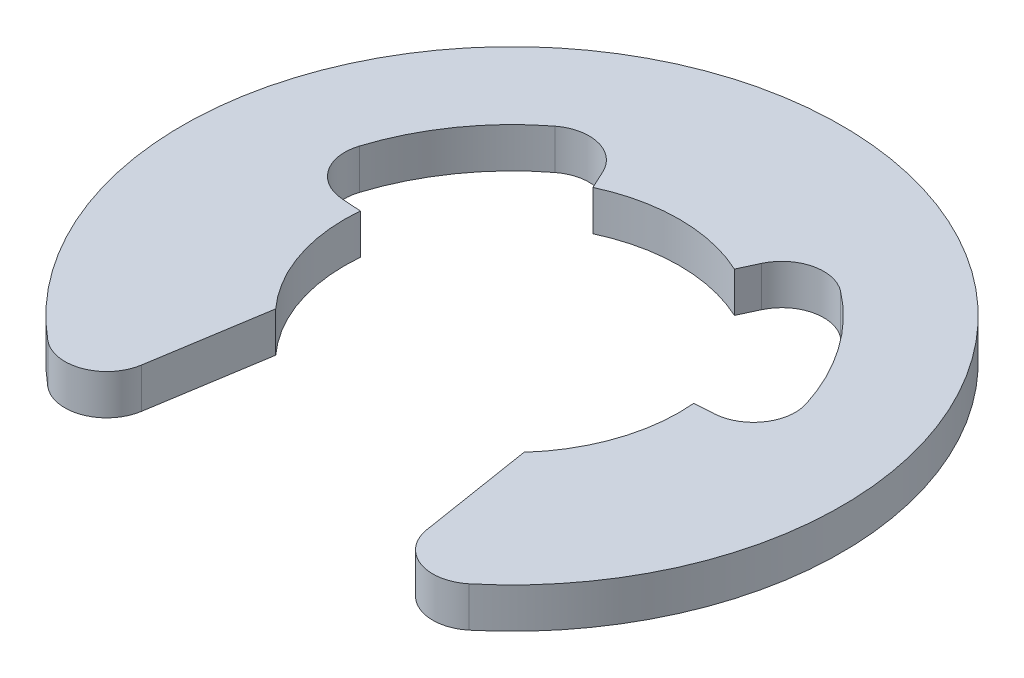
ISO-10303-21;
HEADER;
FILE_DESCRIPTION(('STEP AP214'),'2;1');
FILE_NAME('part.step','',(''),(''),'','','');
FILE_SCHEMA(('AUTOMOTIVE_DESIGN { 1 0 10303 214 1 1 1 1 }'));
ENDSEC;
DATA;
#1=APPLICATION_CONTEXT('core data for automotive mechanical design processes');
#2=APPLICATION_PROTOCOL_DEFINITION('international standard','automotive_design',2000,#1);
#3=PRODUCT_CONTEXT('',#1,'mechanical');
#4=PRODUCT('Part','Part','',(#3));
#5=PRODUCT_RELATED_PRODUCT_CATEGORY('part','',(#4));
#6=PRODUCT_DEFINITION_FORMATION('','',#4);
#7=PRODUCT_DEFINITION_CONTEXT('part definition',#1,'design');
#8=PRODUCT_DEFINITION('design','',#6,#7);
#9=PRODUCT_DEFINITION_SHAPE('','',#8);
#10=(LENGTH_UNIT() NAMED_UNIT(*) SI_UNIT(.MILLI.,.METRE.));
#11=(NAMED_UNIT(*) PLANE_ANGLE_UNIT() SI_UNIT($,.RADIAN.));
#12=(NAMED_UNIT(*) SI_UNIT($,.STERADIAN.) SOLID_ANGLE_UNIT());
#13=UNCERTAINTY_MEASURE_WITH_UNIT(LENGTH_MEASURE(1.E-05),#10,'distance_accuracy_value','');
#14=(GEOMETRIC_REPRESENTATION_CONTEXT(3) GLOBAL_UNCERTAINTY_ASSIGNED_CONTEXT((#13)) GLOBAL_UNIT_ASSIGNED_CONTEXT((#10,
#11,#12)) REPRESENTATION_CONTEXT('',''));
#15=CARTESIAN_POINT('',(0.,0.,0.));
#16=DIRECTION('',(0.,0.,1.));
#17=DIRECTION('',(1.,0.,0.));
#18=AXIS2_PLACEMENT_3D('',#15,#16,#17);
#19=CARTESIAN_POINT('',(3.50482384503729,1.2,-4.55836701190877));
#20=DIRECTION('',(0.,-1.,0.));
#21=DIRECTION('',(0.,0.,-1.));
#22=AXIS2_PLACEMENT_3D('',#19,#20,#21);
#23=CYLINDRICAL_SURFACE('',#22,1.24999999999999);
#24=CARTESIAN_POINT('',(3.50482384503729,0.,-4.55836701190877));
#25=DIRECTION('',(0.,-1.,0.));
#26=DIRECTION('',(0.,0.,-1.));
#27=AXIS2_PLACEMENT_3D('',#24,#25,#26);
#28=CIRCLE('',#27,1.24999999999999);
#29=CARTESIAN_POINT('',(2.37193911124148,0.,-5.08663983908464));
#30=VERTEX_POINT('',#29);
#31=CARTESIAN_POINT('',(4.2667420722193,0.,-5.54931636232372));
#32=VERTEX_POINT('',#31);
#33=EDGE_CURVE('E192',#30,#32,#28,.T.);
#34=ORIENTED_EDGE('',*,*,#33,.T.);
#35=DIRECTION('',(0.,-1.,0.));
#36=VECTOR('',#35,1.);
#37=CARTESIAN_POINT('',(4.2667420722193,1.2,-5.54931636232372));
#38=LINE('',#37,#36);
#39=CARTESIAN_POINT('',(4.2667420722193,1.2,-5.54931636232372));
#40=VERTEX_POINT('',#39);
#41=EDGE_CURVE('E11',#40,#32,#38,.T.);
#42=ORIENTED_EDGE('',*,*,#41,.F.);
#43=CARTESIAN_POINT('',(3.50482384503729,1.2,-4.55836701190877));
#44=DIRECTION('',(0.,-1.,0.));
#45=DIRECTION('',(0.,0.,-1.));
#46=AXIS2_PLACEMENT_3D('',#43,#44,#45);
#47=CIRCLE('',#46,1.24999999999999);
#48=CARTESIAN_POINT('',(2.37193911124148,1.2,-5.08663983908464));
#49=VERTEX_POINT('',#48);
#50=EDGE_CURVE('E226',#49,#40,#47,.T.);
#51=ORIENTED_EDGE('',*,*,#50,.F.);
#52=DIRECTION('',(0.,-1.,0.));
#53=VECTOR('',#52,1.);
#54=CARTESIAN_POINT('',(2.37193911124148,1.2,-5.08663983908464));
#55=LINE('',#54,#53);
#56=EDGE_CURVE('E188',#49,#30,#55,.T.);
#57=ORIENTED_EDGE('',*,*,#56,.T.);
#58=EDGE_LOOP('',(#34,#42,#51,#57));
#59=FACE_BOUND('',#58,.T.);
#60=ADVANCED_FACE('F36',(#59),#23,.F.);
#61=CARTESIAN_POINT('',(0.,1.2,0.));
#62=DIRECTION('',(0.,-1.,0.));
#63=DIRECTION('',(0.,0.,-1.));
#64=AXIS2_PLACEMENT_3D('',#61,#62,#63);
#65=CYLINDRICAL_SURFACE('',#64,7.);
#66=CARTESIAN_POINT('',(0.,0.,0.));
#67=DIRECTION('',(0.,-1.,0.));
#68=DIRECTION('',(0.,0.,1.));
#69=AXIS2_PLACEMENT_3D('',#66,#67,#68);
#70=CIRCLE('',#69,7.);
#71=CARTESIAN_POINT('',(6.67396337115619,0.,-2.11144806245986));
#72=VERTEX_POINT('',#71);
#73=EDGE_CURVE('E195',#32,#72,#70,.T.);
#74=ORIENTED_EDGE('',*,*,#73,.T.);
#75=DIRECTION('',(0.,-1.,0.));
#76=VECTOR('',#75,1.);
#77=CARTESIAN_POINT('',(6.67396337115619,1.2,-2.11144806245986));
#78=LINE('',#77,#76);
#79=CARTESIAN_POINT('',(6.67396337115619,1.2,-2.11144806245986));
#80=VERTEX_POINT('',#79);
#81=EDGE_CURVE('E44',#80,#72,#78,.T.);
#82=ORIENTED_EDGE('',*,*,#81,.F.);
#83=CARTESIAN_POINT('',(0.,1.2,0.));
#84=DIRECTION('',(0.,-1.,0.));
#85=DIRECTION('',(0.,0.,1.));
#86=AXIS2_PLACEMENT_3D('',#83,#84,#85);
#87=CIRCLE('',#86,7.);
#88=EDGE_CURVE('E125',#40,#80,#87,.T.);
#89=ORIENTED_EDGE('',*,*,#88,.F.);
#90=ORIENTED_EDGE('',*,*,#41,.T.);
#91=EDGE_LOOP('',(#74,#82,#89,#90));
#92=FACE_BOUND('',#91,.T.);
#93=ADVANCED_FACE('F334',(#92),#65,.F.);
#94=CARTESIAN_POINT('',(5.48218419773545,1.2,-1.73440376559203));
#95=DIRECTION('',(0.,-1.,0.));
#96=DIRECTION('',(0.,0.,-1.));
#97=AXIS2_PLACEMENT_3D('',#94,#95,#96);
#98=CYLINDRICAL_SURFACE('',#97,1.24999999999999);
#99=CARTESIAN_POINT('',(5.48218419773545,0.,-1.73440376559203));
#100=DIRECTION('',(0.,-1.,0.));
#101=DIRECTION('',(0.,0.,1.));
#102=AXIS2_PLACEMENT_3D('',#99,#100,#101);
#103=CIRCLE('',#102,1.24999999999999);
#104=CARTESIAN_POINT('',(5.56808287520105,0.,-0.487358691342648));
#105=VERTEX_POINT('',#104);
#106=EDGE_CURVE('E197',#72,#105,#103,.T.);
#107=ORIENTED_EDGE('',*,*,#106,.T.);
#108=DIRECTION('',(0.,-1.,0.));
#109=VECTOR('',#108,1.);
#110=CARTESIAN_POINT('',(5.56808287520105,1.2,-0.487358691342648));
#111=LINE('',#110,#109);
#112=CARTESIAN_POINT('',(5.56808287520105,1.2,-0.487358691342648));
#113=VERTEX_POINT('',#112);
#114=EDGE_CURVE('E263',#113,#105,#111,.T.);
#115=ORIENTED_EDGE('',*,*,#114,.F.);
#116=CARTESIAN_POINT('',(5.48218419773545,1.2,-1.73440376559203));
#117=DIRECTION('',(0.,-1.,0.));
#118=DIRECTION('',(0.,0.,1.));
#119=AXIS2_PLACEMENT_3D('',#116,#117,#118);
#120=CIRCLE('',#119,1.24999999999999);
#121=EDGE_CURVE('E271',#80,#113,#120,.T.);
#122=ORIENTED_EDGE('',*,*,#121,.F.);
#123=ORIENTED_EDGE('',*,*,#81,.T.);
#124=EDGE_LOOP('',(#107,#115,#122,#123));
#125=FACE_BOUND('',#124,.T.);
#126=ADVANCED_FACE('F269',(#125),#98,.F.);
#127=CARTESIAN_POINT('',(4.97999247932663,1.2,-0.446849981369804));
#128=DIRECTION('',(0.0687189419724793,0.,0.99763605939951));
#129=DIRECTION('',(0.99763605939951,0.,-0.0687189419724793));
#130=AXIS2_PLACEMENT_3D('',#127,#128,#129);
#131=PLANE('',#130);
#132=DIRECTION('',(-0.99763605939951,0.,0.0687189419724793));
#133=VECTOR('',#132,1.);
#134=CARTESIAN_POINT('',(4.97999247932663,0.,-0.446849981369804));
#135=LINE('',#134,#133);
#136=CARTESIAN_POINT('',(4.97999247932663,0.,-0.446849981369804));
#137=VERTEX_POINT('',#136);
#138=EDGE_CURVE('E199',#105,#137,#135,.T.);
#139=ORIENTED_EDGE('',*,*,#138,.T.);
#140=DIRECTION('',(0.,-1.,0.));
#141=VECTOR('',#140,1.);
#142=CARTESIAN_POINT('',(4.97999247932663,1.2,-0.446849981369804));
#143=LINE('',#142,#141);
#144=CARTESIAN_POINT('',(4.97999247932663,1.2,-0.446849981369804));
#145=VERTEX_POINT('',#144);
#146=EDGE_CURVE('E260',#145,#137,#143,.T.);
#147=ORIENTED_EDGE('',*,*,#146,.F.);
#148=DIRECTION('',(-0.99763605939951,0.,0.0687189419724793));
#149=VECTOR('',#148,1.);
#150=CARTESIAN_POINT('',(4.97999247932663,1.2,-0.446849981369804));
#151=LINE('',#150,#149);
#152=EDGE_CURVE('E289',#113,#145,#151,.T.);
#153=ORIENTED_EDGE('',*,*,#152,.F.);
#154=ORIENTED_EDGE('',*,*,#114,.T.);
#155=EDGE_LOOP('',(#139,#147,#153,#154));
#156=FACE_BOUND('',#155,.T.);
#157=ADVANCED_FACE('F280',(#156),#131,.F.);
#158=CARTESIAN_POINT('',(0.,1.2,0.));
#159=DIRECTION('',(0.,-1.,0.));
#160=DIRECTION('',(0.,0.,-1.));
#161=AXIS2_PLACEMENT_3D('',#158,#159,#160);
#162=CYLINDRICAL_SURFACE('',#161,5.);
#163=CARTESIAN_POINT('',(0.,0.,0.));
#164=DIRECTION('',(0.,-1.,0.));
#165=DIRECTION('',(0.,0.,1.));
#166=AXIS2_PLACEMENT_3D('',#163,#164,#165);
#167=CIRCLE('',#166,5.);
#168=CARTESIAN_POINT('',(3.71082851381224,0.,3.35108217462331));
#169=VERTEX_POINT('',#168);
#170=EDGE_CURVE('E201',#137,#169,#167,.T.);
#171=ORIENTED_EDGE('',*,*,#170,.T.);
#172=DIRECTION('',(0.,-1.,0.));
#173=VECTOR('',#172,1.);
#174=CARTESIAN_POINT('',(3.71082851381224,1.2,3.35108217462331));
#175=LINE('',#174,#173);
#176=CARTESIAN_POINT('',(3.71082851381224,1.2,3.35108217462331));
#177=VERTEX_POINT('',#176);
#178=EDGE_CURVE('E257',#177,#169,#175,.T.);
#179=ORIENTED_EDGE('',*,*,#178,.F.);
#180=CARTESIAN_POINT('',(0.,1.2,0.));
#181=DIRECTION('',(0.,-1.,0.));
#182=DIRECTION('',(0.,0.,1.));
#183=AXIS2_PLACEMENT_3D('',#180,#181,#182);
#184=CIRCLE('',#183,5.);
#185=EDGE_CURVE('E286',#145,#177,#184,.T.);
#186=ORIENTED_EDGE('',*,*,#185,.F.);
#187=ORIENTED_EDGE('',*,*,#146,.T.);
#188=EDGE_LOOP('',(#171,#179,#186,#187));
#189=FACE_BOUND('',#188,.T.);
#190=ADVANCED_FACE('F284',(#189),#162,.F.);
#191=CARTESIAN_POINT('',(3.71082851381224,1.2,3.35108217462331));
#192=DIRECTION('',(0.987539000514755,0.,-0.157374465725288));
#193=DIRECTION('',(-0.157374465725288,0.,-0.987539000514755));
#194=AXIS2_PLACEMENT_3D('',#191,#192,#193);
#195=PLANE('',#194);
#196=DIRECTION('',(0.157374465725288,0.,0.987539000514754));
#197=VECTOR('',#196,1.);
#198=CARTESIAN_POINT('',(3.71082851381224,0.,3.35108217462331));
#199=LINE('',#198,#197);
#200=CARTESIAN_POINT('',(4.26218467581493,0.,6.8108919388213));
#201=VERTEX_POINT('',#200);
#202=EDGE_CURVE('E203',#169,#201,#199,.T.);
#203=ORIENTED_EDGE('',*,*,#202,.T.);
#204=DIRECTION('',(0.,-1.,0.));
#205=VECTOR('',#204,1.);
#206=CARTESIAN_POINT('',(4.26218467581493,1.2,6.8108919388213));
#207=LINE('',#206,#205);
#208=CARTESIAN_POINT('',(4.26218467581493,1.2,6.8108919388213));
#209=VERTEX_POINT('',#208);
#210=EDGE_CURVE('E254',#209,#201,#207,.T.);
#211=ORIENTED_EDGE('',*,*,#210,.F.);
#212=DIRECTION('',(0.157374465725288,0.,0.987539000514754));
#213=VECTOR('',#212,1.);
#214=CARTESIAN_POINT('',(3.71082851381224,1.2,3.35108217462331));
#215=LINE('',#214,#213);
#216=EDGE_CURVE('E288',#177,#209,#215,.T.);
#217=ORIENTED_EDGE('',*,*,#216,.F.);
#218=ORIENTED_EDGE('',*,*,#178,.T.);
#219=EDGE_LOOP('',(#203,#211,#217,#218));
#220=FACE_BOUND('',#219,.T.);
#221=ADVANCED_FACE('F347',(#220),#195,.F.);
#222=CARTESIAN_POINT('',(5.49660842645838,1.2,6.61417385666469));
#223=DIRECTION('',(0.,-1.,0.));
#224=DIRECTION('',(0.,0.,-1.));
#225=AXIS2_PLACEMENT_3D('',#222,#223,#224);
#226=CYLINDRICAL_SURFACE('',#225,1.25);
#227=CARTESIAN_POINT('',(5.49660842645838,0.,6.61417385666469));
#228=DIRECTION('',(0.,1.,0.));
#229=DIRECTION('',(0.,0.,1.));
#230=AXIS2_PLACEMENT_3D('',#227,#228,#229);
#231=CIRCLE('',#230,1.25);
#232=CARTESIAN_POINT('',(6.29553406983896,0.,7.57553633583107));
#233=VERTEX_POINT('',#232);
#234=EDGE_CURVE('E205',#201,#233,#231,.T.);
#235=ORIENTED_EDGE('',*,*,#234,.T.);
#236=DIRECTION('',(0.,-1.,0.));
#237=VECTOR('',#236,1.);
#238=CARTESIAN_POINT('',(6.29553406983896,1.2,7.57553633583107));
#239=LINE('',#238,#237);
#240=CARTESIAN_POINT('',(6.29553406983896,1.2,7.57553633583107));
#241=VERTEX_POINT('',#240);
#242=EDGE_CURVE('E251',#241,#233,#239,.T.);
#243=ORIENTED_EDGE('',*,*,#242,.F.);
#244=CARTESIAN_POINT('',(5.49660842645838,1.2,6.61417385666469));
#245=DIRECTION('',(0.,1.,0.));
#246=DIRECTION('',(0.,0.,1.));
#247=AXIS2_PLACEMENT_3D('',#244,#245,#246);
#248=CIRCLE('',#247,1.25);
#249=EDGE_CURVE('E291',#209,#241,#248,.T.);
#250=ORIENTED_EDGE('',*,*,#249,.F.);
#251=ORIENTED_EDGE('',*,*,#210,.T.);
#252=EDGE_LOOP('',(#235,#243,#250,#251));
#253=FACE_BOUND('',#252,.T.);
#254=ADVANCED_FACE('F350',(#253),#226,.T.);
#255=CARTESIAN_POINT('',(0.,1.2,0.));
#256=DIRECTION('',(0.,-1.,0.));
#257=DIRECTION('',(0.,0.,-1.));
#258=AXIS2_PLACEMENT_3D('',#255,#256,#257);
#259=CYLINDRICAL_SURFACE('',#258,9.85);
#260=CARTESIAN_POINT('',(0.,0.,0.));
#261=DIRECTION('',(0.,1.,0.));
#262=DIRECTION('',(0.,0.,1.));
#263=AXIS2_PLACEMENT_3D('',#260,#261,#262);
#264=CIRCLE('',#263,9.85);
#265=CARTESIAN_POINT('',(-6.29553406983896,0.,7.57553633583108));
#266=VERTEX_POINT('',#265);
#267=EDGE_CURVE('E207',#233,#266,#264,.T.);
#268=ORIENTED_EDGE('',*,*,#267,.T.);
#269=DIRECTION('',(0.,-1.,0.));
#270=VECTOR('',#269,1.);
#271=CARTESIAN_POINT('',(-6.29553406983896,1.2,7.57553633583108));
#272=LINE('',#271,#270);
#273=CARTESIAN_POINT('',(-6.29553406983896,1.2,7.57553633583108));
#274=VERTEX_POINT('',#273);
#275=EDGE_CURVE('E248',#274,#266,#272,.T.);
#276=ORIENTED_EDGE('',*,*,#275,.F.);
#277=CARTESIAN_POINT('',(0.,1.2,0.));
#278=DIRECTION('',(0.,1.,0.));
#279=DIRECTION('',(0.,0.,1.));
#280=AXIS2_PLACEMENT_3D('',#277,#278,#279);
#281=CIRCLE('',#280,9.85);
#282=EDGE_CURVE('E297',#241,#274,#281,.T.);
#283=ORIENTED_EDGE('',*,*,#282,.F.);
#284=ORIENTED_EDGE('',*,*,#242,.T.);
#285=EDGE_LOOP('',(#268,#276,#283,#284));
#286=FACE_BOUND('',#285,.T.);
#287=ADVANCED_FACE('F354',(#286),#259,.T.);
#288=CARTESIAN_POINT('',(-5.49660842645838,1.2,6.61417385666469));
#289=DIRECTION('',(0.,-1.,0.));
#290=DIRECTION('',(0.,0.,-1.));
#291=AXIS2_PLACEMENT_3D('',#288,#289,#290);
#292=CYLINDRICAL_SURFACE('',#291,1.25);
#293=CARTESIAN_POINT('',(-5.49660842645838,0.,6.61417385666469));
#294=DIRECTION('',(0.,1.,0.));
#295=DIRECTION('',(0.,0.,-1.));
#296=AXIS2_PLACEMENT_3D('',#293,#294,#295);
#297=CIRCLE('',#296,1.25);
#298=CARTESIAN_POINT('',(-4.26218467581493,0.,6.8108919388213));
#299=VERTEX_POINT('',#298);
#300=EDGE_CURVE('E209',#266,#299,#297,.T.);
#301=ORIENTED_EDGE('',*,*,#300,.T.);
#302=DIRECTION('',(0.,-1.,0.));
#303=VECTOR('',#302,1.);
#304=CARTESIAN_POINT('',(-4.26218467581493,1.2,6.8108919388213));
#305=LINE('',#304,#303);
#306=CARTESIAN_POINT('',(-4.26218467581493,1.2,6.8108919388213));
#307=VERTEX_POINT('',#306);
#308=EDGE_CURVE('E245',#307,#299,#305,.T.);
#309=ORIENTED_EDGE('',*,*,#308,.F.);
#310=CARTESIAN_POINT('',(-5.49660842645838,1.2,6.61417385666469));
#311=DIRECTION('',(0.,1.,0.));
#312=DIRECTION('',(0.,0.,-1.));
#313=AXIS2_PLACEMENT_3D('',#310,#311,#312);
#314=CIRCLE('',#313,1.25);
#315=EDGE_CURVE('E299',#274,#307,#314,.T.);
#316=ORIENTED_EDGE('',*,*,#315,.F.);
#317=ORIENTED_EDGE('',*,*,#275,.T.);
#318=EDGE_LOOP('',(#301,#309,#316,#317));
#319=FACE_BOUND('',#318,.T.);
#320=ADVANCED_FACE('F358',(#319),#292,.T.);
#321=CARTESIAN_POINT('',(-3.71082851381224,1.2,3.35108217462331));
#322=DIRECTION('',(-0.987539000514755,0.,-0.157374465725287));
#323=DIRECTION('',(-0.157374465725287,0.,0.987539000514755));
#324=AXIS2_PLACEMENT_3D('',#321,#322,#323);
#325=PLANE('',#324);
#326=DIRECTION('',(0.157374465725287,0.,-0.987539000514755));
#327=VECTOR('',#326,1.);
#328=CARTESIAN_POINT('',(-3.71082851381224,0.,3.35108217462331));
#329=LINE('',#328,#327);
#330=CARTESIAN_POINT('',(-3.71082851381224,0.,3.35108217462331));
#331=VERTEX_POINT('',#330);
#332=EDGE_CURVE('E211',#299,#331,#329,.T.);
#333=ORIENTED_EDGE('',*,*,#332,.T.);
#334=DIRECTION('',(0.,-1.,0.));
#335=VECTOR('',#334,1.);
#336=CARTESIAN_POINT('',(-3.71082851381224,1.2,3.35108217462331));
#337=LINE('',#336,#335);
#338=CARTESIAN_POINT('',(-3.71082851381224,1.2,3.35108217462331));
#339=VERTEX_POINT('',#338);
#340=EDGE_CURVE('E242',#339,#331,#337,.T.);
#341=ORIENTED_EDGE('',*,*,#340,.F.);
#342=DIRECTION('',(0.157374465725287,0.,-0.987539000514755));
#343=VECTOR('',#342,1.);
#344=CARTESIAN_POINT('',(-3.71082851381224,1.2,3.35108217462331));
#345=LINE('',#344,#343);
#346=EDGE_CURVE('E301',#307,#339,#345,.T.);
#347=ORIENTED_EDGE('',*,*,#346,.F.);
#348=ORIENTED_EDGE('',*,*,#308,.T.);
#349=EDGE_LOOP('',(#333,#341,#347,#348));
#350=FACE_BOUND('',#349,.T.);
#351=ADVANCED_FACE('F362',(#350),#325,.F.);
#352=CARTESIAN_POINT('',(0.,1.2,0.));
#353=DIRECTION('',(0.,-1.,0.));
#354=DIRECTION('',(0.,0.,-1.));
#355=AXIS2_PLACEMENT_3D('',#352,#353,#354);
#356=CYLINDRICAL_SURFACE('',#355,5.);
#357=CARTESIAN_POINT('',(0.,0.,0.));
#358=DIRECTION('',(0.,-1.,0.));
#359=DIRECTION('',(0.,0.,-1.));
#360=AXIS2_PLACEMENT_3D('',#357,#358,#359);
#361=CIRCLE('',#360,5.);
#362=CARTESIAN_POINT('',(-4.97999247932663,0.,-0.446849981369804));
#363=VERTEX_POINT('',#362);
#364=EDGE_CURVE('E213',#331,#363,#361,.T.);
#365=ORIENTED_EDGE('',*,*,#364,.T.);
#366=DIRECTION('',(0.,-1.,0.));
#367=VECTOR('',#366,1.);
#368=CARTESIAN_POINT('',(-4.97999247932663,1.2,-0.446849981369804));
#369=LINE('',#368,#367);
#370=CARTESIAN_POINT('',(-4.97999247932663,1.2,-0.446849981369804));
#371=VERTEX_POINT('',#370);
#372=EDGE_CURVE('E239',#371,#363,#369,.T.);
#373=ORIENTED_EDGE('',*,*,#372,.F.);
#374=CARTESIAN_POINT('',(0.,1.2,0.));
#375=DIRECTION('',(0.,-1.,0.));
#376=DIRECTION('',(0.,0.,-1.));
#377=AXIS2_PLACEMENT_3D('',#374,#375,#376);
#378=CIRCLE('',#377,5.);
#379=EDGE_CURVE('E303',#339,#371,#378,.T.);
#380=ORIENTED_EDGE('',*,*,#379,.F.);
#381=ORIENTED_EDGE('',*,*,#340,.T.);
#382=EDGE_LOOP('',(#365,#373,#380,#381));
#383=FACE_BOUND('',#382,.T.);
#384=ADVANCED_FACE('F366',(#383),#356,.F.);
#385=CARTESIAN_POINT('',(-4.97999247932663,1.2,-0.446849981369804));
#386=DIRECTION('',(-0.0687189419724795,0.,0.99763605939951));
#387=DIRECTION('',(0.99763605939951,0.,0.0687189419724795));
#388=AXIS2_PLACEMENT_3D('',#385,#386,#387);
#389=PLANE('',#388);
#390=DIRECTION('',(-0.99763605939951,0.,-0.0687189419724795));
#391=VECTOR('',#390,1.);
#392=CARTESIAN_POINT('',(-4.97999247932663,0.,-0.446849981369804));
#393=LINE('',#392,#391);
#394=CARTESIAN_POINT('',(-5.56808287520105,0.,-0.487358691342647));
#395=VERTEX_POINT('',#394);
#396=EDGE_CURVE('E215',#363,#395,#393,.T.);
#397=ORIENTED_EDGE('',*,*,#396,.T.);
#398=DIRECTION('',(0.,-1.,0.));
#399=VECTOR('',#398,1.);
#400=CARTESIAN_POINT('',(-5.56808287520105,1.2,-0.487358691342647));
#401=LINE('',#400,#399);
#402=CARTESIAN_POINT('',(-5.56808287520105,1.2,-0.487358691342647));
#403=VERTEX_POINT('',#402);
#404=EDGE_CURVE('E236',#403,#395,#401,.T.);
#405=ORIENTED_EDGE('',*,*,#404,.F.);
#406=DIRECTION('',(-0.99763605939951,0.,-0.0687189419724795));
#407=VECTOR('',#406,1.);
#408=CARTESIAN_POINT('',(-4.97999247932663,1.2,-0.446849981369804));
#409=LINE('',#408,#407);
#410=EDGE_CURVE('E305',#371,#403,#409,.T.);
#411=ORIENTED_EDGE('',*,*,#410,.F.);
#412=ORIENTED_EDGE('',*,*,#372,.T.);
#413=EDGE_LOOP('',(#397,#405,#411,#412));
#414=FACE_BOUND('',#413,.T.);
#415=ADVANCED_FACE('F370',(#414),#389,.F.);
#416=CARTESIAN_POINT('',(-5.48218419773545,1.2,-1.73440376559203));
#417=DIRECTION('',(0.,-1.,0.));
#418=DIRECTION('',(0.,0.,-1.));
#419=AXIS2_PLACEMENT_3D('',#416,#417,#418);
#420=CYLINDRICAL_SURFACE('',#419,1.25);
#421=CARTESIAN_POINT('',(-5.48218419773545,0.,-1.73440376559203));
#422=DIRECTION('',(0.,-1.,0.));
#423=DIRECTION('',(0.,0.,-1.));
#424=AXIS2_PLACEMENT_3D('',#421,#422,#423);
#425=CIRCLE('',#424,1.25);
#426=CARTESIAN_POINT('',(-6.67396337115619,0.,-2.11144806245986));
#427=VERTEX_POINT('',#426);
#428=EDGE_CURVE('E217',#395,#427,#425,.T.);
#429=ORIENTED_EDGE('',*,*,#428,.T.);
#430=DIRECTION('',(0.,-1.,0.));
#431=VECTOR('',#430,1.);
#432=CARTESIAN_POINT('',(-6.67396337115619,1.2,-2.11144806245986));
#433=LINE('',#432,#431);
#434=CARTESIAN_POINT('',(-6.67396337115619,1.2,-2.11144806245986));
#435=VERTEX_POINT('',#434);
#436=EDGE_CURVE('E233',#435,#427,#433,.T.);
#437=ORIENTED_EDGE('',*,*,#436,.F.);
#438=CARTESIAN_POINT('',(-5.48218419773545,1.2,-1.73440376559203));
#439=DIRECTION('',(0.,-1.,0.));
#440=DIRECTION('',(0.,0.,-1.));
#441=AXIS2_PLACEMENT_3D('',#438,#439,#440);
#442=CIRCLE('',#441,1.25);
#443=EDGE_CURVE('E307',#403,#435,#442,.T.);
#444=ORIENTED_EDGE('',*,*,#443,.F.);
#445=ORIENTED_EDGE('',*,*,#404,.T.);
#446=EDGE_LOOP('',(#429,#437,#444,#445));
#447=FACE_BOUND('',#446,.T.);
#448=ADVANCED_FACE('F374',(#447),#420,.F.);
#449=CARTESIAN_POINT('',(0.,1.2,0.));
#450=DIRECTION('',(0.,-1.,0.));
#451=DIRECTION('',(0.,0.,-1.));
#452=AXIS2_PLACEMENT_3D('',#449,#450,#451);
#453=CYLINDRICAL_SURFACE('',#452,7.);
#454=CARTESIAN_POINT('',(0.,0.,0.));
#455=DIRECTION('',(0.,-1.,0.));
#456=DIRECTION('',(0.,0.,-1.));
#457=AXIS2_PLACEMENT_3D('',#454,#455,#456);
#458=CIRCLE('',#457,7.);
#459=CARTESIAN_POINT('',(-4.2667420722193,0.,-5.54931636232372));
#460=VERTEX_POINT('',#459);
#461=EDGE_CURVE('E219',#427,#460,#458,.T.);
#462=ORIENTED_EDGE('',*,*,#461,.T.);
#463=DIRECTION('',(0.,-1.,0.));
#464=VECTOR('',#463,1.);
#465=CARTESIAN_POINT('',(-4.2667420722193,1.2,-5.54931636232372));
#466=LINE('',#465,#464);
#467=CARTESIAN_POINT('',(-4.2667420722193,1.2,-5.54931636232372));
#468=VERTEX_POINT('',#467);
#469=EDGE_CURVE('E230',#468,#460,#466,.T.);
#470=ORIENTED_EDGE('',*,*,#469,.F.);
#471=CARTESIAN_POINT('',(0.,1.2,0.));
#472=DIRECTION('',(0.,-1.,0.));
#473=DIRECTION('',(0.,0.,-1.));
#474=AXIS2_PLACEMENT_3D('',#471,#472,#473);
#475=CIRCLE('',#474,7.);
#476=EDGE_CURVE('E309',#435,#468,#475,.T.);
#477=ORIENTED_EDGE('',*,*,#476,.F.);
#478=ORIENTED_EDGE('',*,*,#436,.T.);
#479=EDGE_LOOP('',(#462,#470,#477,#478));
#480=FACE_BOUND('',#479,.T.);
#481=ADVANCED_FACE('F315',(#480),#453,.F.);
#482=CARTESIAN_POINT('',(-3.50482384503729,1.2,-4.55836701190877));
#483=DIRECTION('',(0.,-1.,0.));
#484=DIRECTION('',(0.,0.,-1.));
#485=AXIS2_PLACEMENT_3D('',#482,#483,#484);
#486=CYLINDRICAL_SURFACE('',#485,1.24999999999999);
#487=CARTESIAN_POINT('',(-3.50482384503729,0.,-4.55836701190877));
#488=DIRECTION('',(0.,-1.,0.));
#489=DIRECTION('',(0.,0.,1.));
#490=AXIS2_PLACEMENT_3D('',#487,#488,#489);
#491=CIRCLE('',#490,1.24999999999999);
#492=CARTESIAN_POINT('',(-2.37193911124148,0.,-5.08663983908464));
#493=VERTEX_POINT('',#492);
#494=EDGE_CURVE('E221',#460,#493,#491,.T.);
#495=ORIENTED_EDGE('',*,*,#494,.T.);
#496=DIRECTION('',(0.,-1.,0.));
#497=VECTOR('',#496,1.);
#498=CARTESIAN_POINT('',(-2.37193911124148,1.2,-5.08663983908464));
#499=LINE('',#498,#497);
#500=CARTESIAN_POINT('',(-2.37193911124148,1.2,-5.08663983908464));
#501=VERTEX_POINT('',#500);
#502=EDGE_CURVE('E183',#501,#493,#499,.T.);
#503=ORIENTED_EDGE('',*,*,#502,.F.);
#504=CARTESIAN_POINT('',(-3.50482384503729,1.2,-4.55836701190877));
#505=DIRECTION('',(0.,-1.,0.));
#506=DIRECTION('',(0.,0.,1.));
#507=AXIS2_PLACEMENT_3D('',#504,#505,#506);
#508=CIRCLE('',#507,1.24999999999999);
#509=EDGE_CURVE('E174',#468,#501,#508,.T.);
#510=ORIENTED_EDGE('',*,*,#509,.F.);
#511=ORIENTED_EDGE('',*,*,#469,.T.);
#512=EDGE_LOOP('',(#495,#503,#510,#511));
#513=FACE_BOUND('',#512,.T.);
#514=ADVANCED_FACE('F319',(#513),#486,.F.);
#515=CARTESIAN_POINT('',(-2.1130913087035,1.2,-4.53153893518325));
#516=DIRECTION('',(0.90630778703665,0.,-0.422618261740699));
#517=DIRECTION('',(-0.422618261740699,0.,-0.90630778703665));
#518=AXIS2_PLACEMENT_3D('',#515,#516,#517);
#519=PLANE('',#518);
#520=DIRECTION('',(0.422618261740699,0.,0.90630778703665));
#521=VECTOR('',#520,1.);
#522=CARTESIAN_POINT('',(-2.1130913087035,0.,-4.53153893518325));
#523=LINE('',#522,#521);
#524=CARTESIAN_POINT('',(-2.1130913087035,0.,-4.53153893518325));
#525=VERTEX_POINT('',#524);
#526=EDGE_CURVE('E182',#493,#525,#523,.T.);
#527=ORIENTED_EDGE('',*,*,#526,.T.);
#528=DIRECTION('',(0.,-1.,0.));
#529=VECTOR('',#528,1.);
#530=CARTESIAN_POINT('',(-2.1130913087035,1.2,-4.53153893518325));
#531=LINE('',#530,#529);
#532=CARTESIAN_POINT('',(-2.1130913087035,1.2,-4.53153893518325));
#533=VERTEX_POINT('',#532);
#534=EDGE_CURVE('E179',#533,#525,#531,.T.);
#535=ORIENTED_EDGE('',*,*,#534,.F.);
#536=DIRECTION('',(0.422618261740699,0.,0.90630778703665));
#537=VECTOR('',#536,1.);
#538=CARTESIAN_POINT('',(-2.1130913087035,1.2,-4.53153893518325));
#539=LINE('',#538,#537);
#540=EDGE_CURVE('E168',#501,#533,#539,.T.);
#541=ORIENTED_EDGE('',*,*,#540,.F.);
#542=ORIENTED_EDGE('',*,*,#502,.T.);
#543=EDGE_LOOP('',(#527,#535,#541,#542));
#544=FACE_BOUND('',#543,.T.);
#545=ADVANCED_FACE('F180',(#544),#519,.F.);
#546=CARTESIAN_POINT('',(0.,1.2,0.));
#547=DIRECTION('',(0.,-1.,0.));
#548=DIRECTION('',(0.,0.,-1.));
#549=AXIS2_PLACEMENT_3D('',#546,#547,#548);
#550=CYLINDRICAL_SURFACE('',#549,5.);
#551=CARTESIAN_POINT('',(0.,0.,0.));
#552=DIRECTION('',(0.,-1.,0.));
#553=DIRECTION('',(0.,0.,1.));
#554=AXIS2_PLACEMENT_3D('',#551,#552,#553);
#555=CIRCLE('',#554,5.);
#556=CARTESIAN_POINT('',(2.1130913087035,0.,-4.53153893518325));
#557=VERTEX_POINT('',#556);
#558=EDGE_CURVE('E111',#525,#557,#555,.T.);
#559=ORIENTED_EDGE('',*,*,#558,.T.);
#560=DIRECTION('',(0.,-1.,0.));
#561=VECTOR('',#560,1.);
#562=CARTESIAN_POINT('',(2.1130913087035,1.2,-4.53153893518325));
#563=LINE('',#562,#561);
#564=CARTESIAN_POINT('',(2.1130913087035,1.2,-4.53153893518325));
#565=VERTEX_POINT('',#564);
#566=EDGE_CURVE('E184',#565,#557,#563,.T.);
#567=ORIENTED_EDGE('',*,*,#566,.F.);
#568=CARTESIAN_POINT('',(0.,1.2,0.));
#569=DIRECTION('',(0.,-1.,0.));
#570=DIRECTION('',(0.,0.,1.));
#571=AXIS2_PLACEMENT_3D('',#568,#569,#570);
#572=CIRCLE('',#571,5.);
#573=EDGE_CURVE('E172',#533,#565,#572,.T.);
#574=ORIENTED_EDGE('',*,*,#573,.F.);
#575=ORIENTED_EDGE('',*,*,#534,.T.);
#576=EDGE_LOOP('',(#559,#567,#574,#575));
#577=FACE_BOUND('',#576,.T.);
#578=ADVANCED_FACE('F186',(#577),#550,.F.);
#579=CARTESIAN_POINT('',(2.1130913087035,1.2,-4.53153893518325));
#580=DIRECTION('',(-0.90630778703665,0.,-0.422618261740699));
#581=DIRECTION('',(-0.422618261740699,0.,0.90630778703665));
#582=AXIS2_PLACEMENT_3D('',#579,#580,#581);
#583=PLANE('',#582);
#584=DIRECTION('',(0.422618261740699,0.,-0.90630778703665));
#585=VECTOR('',#584,1.);
#586=CARTESIAN_POINT('',(2.1130913087035,0.,-4.53153893518325));
#587=LINE('',#586,#585);
#588=EDGE_CURVE('E117',#557,#30,#587,.T.);
#589=ORIENTED_EDGE('',*,*,#588,.T.);
#590=ORIENTED_EDGE('',*,*,#56,.F.);
#591=DIRECTION('',(0.422618261740699,0.,-0.90630778703665));
#592=VECTOR('',#591,1.);
#593=CARTESIAN_POINT('',(2.1130913087035,1.2,-4.53153893518325));
#594=LINE('',#593,#592);
#595=EDGE_CURVE('E52',#565,#49,#594,.T.);
#596=ORIENTED_EDGE('',*,*,#595,.F.);
#597=ORIENTED_EDGE('',*,*,#566,.T.);
#598=EDGE_LOOP('',(#589,#590,#596,#597));
#599=FACE_BOUND('',#598,.T.);
#600=ADVANCED_FACE('F323',(#599),#583,.F.);
#601=CARTESIAN_POINT('',(3.50482384503729,1.2,-4.55836701190877));
#602=DIRECTION('',(0.,-1.,0.));
#603=DIRECTION('',(0.,0.,-1.));
#604=AXIS2_PLACEMENT_3D('',#601,#602,#603);
#605=PLANE('',#604);
#606=ORIENTED_EDGE('',*,*,#50,.T.);
#607=ORIENTED_EDGE('',*,*,#88,.T.);
#608=ORIENTED_EDGE('',*,*,#121,.T.);
#609=ORIENTED_EDGE('',*,*,#152,.T.);
#610=ORIENTED_EDGE('',*,*,#185,.T.);
#611=ORIENTED_EDGE('',*,*,#216,.T.);
#612=ORIENTED_EDGE('',*,*,#249,.T.);
#613=ORIENTED_EDGE('',*,*,#282,.T.);
#614=ORIENTED_EDGE('',*,*,#315,.T.);
#615=ORIENTED_EDGE('',*,*,#346,.T.);
#616=ORIENTED_EDGE('',*,*,#379,.T.);
#617=ORIENTED_EDGE('',*,*,#410,.T.);
#618=ORIENTED_EDGE('',*,*,#443,.T.);
#619=ORIENTED_EDGE('',*,*,#476,.T.);
#620=ORIENTED_EDGE('',*,*,#509,.T.);
#621=ORIENTED_EDGE('',*,*,#540,.T.);
#622=ORIENTED_EDGE('',*,*,#573,.T.);
#623=ORIENTED_EDGE('',*,*,#595,.T.);
#624=EDGE_LOOP('',(#606,#607,#608,#609,#610,#611,#612,#613,#614,#615,#616,#617,#618,#619,#620,
#621,#622,#623));
#625=FACE_BOUND('',#624,.T.);
#626=ADVANCED_FACE('F170',(#625),#605,.F.);
#627=CARTESIAN_POINT('',(3.50482384503729,0.,-4.55836701190877));
#628=DIRECTION('',(0.,-1.,0.));
#629=DIRECTION('',(0.,0.,-1.));
#630=AXIS2_PLACEMENT_3D('',#627,#628,#629);
#631=PLANE('',#630);
#632=ORIENTED_EDGE('',*,*,#33,.F.);
#633=ORIENTED_EDGE('',*,*,#588,.F.);
#634=ORIENTED_EDGE('',*,*,#558,.F.);
#635=ORIENTED_EDGE('',*,*,#526,.F.);
#636=ORIENTED_EDGE('',*,*,#494,.F.);
#637=ORIENTED_EDGE('',*,*,#461,.F.);
#638=ORIENTED_EDGE('',*,*,#428,.F.);
#639=ORIENTED_EDGE('',*,*,#396,.F.);
#640=ORIENTED_EDGE('',*,*,#364,.F.);
#641=ORIENTED_EDGE('',*,*,#332,.F.);
#642=ORIENTED_EDGE('',*,*,#300,.F.);
#643=ORIENTED_EDGE('',*,*,#267,.F.);
#644=ORIENTED_EDGE('',*,*,#234,.F.);
#645=ORIENTED_EDGE('',*,*,#202,.F.);
#646=ORIENTED_EDGE('',*,*,#170,.F.);
#647=ORIENTED_EDGE('',*,*,#138,.F.);
#648=ORIENTED_EDGE('',*,*,#106,.F.);
#649=ORIENTED_EDGE('',*,*,#73,.F.);
#650=EDGE_LOOP('',(#632,#633,#634,#635,#636,#637,#638,#639,#640,#641,#642,#643,#644,#645,#646,
#647,#648,#649));
#651=FACE_BOUND('',#650,.T.);
#652=ADVANCED_FACE('F275',(#651),#631,.T.);
#653=CLOSED_SHELL('',(#60,#93,#126,#157,#190,#221,#254,#287,#320,#351,#384,#415,#448,#481,#514,
#545,#578,#600,#626,#652));
#654=MANIFOLD_SOLID_BREP('B2',#653);
#655=ADVANCED_BREP_SHAPE_REPRESENTATION('',(#18,#654),#14);
#656=SHAPE_DEFINITION_REPRESENTATION(#9,#655);
ENDSEC;
END-ISO-10303-21;
